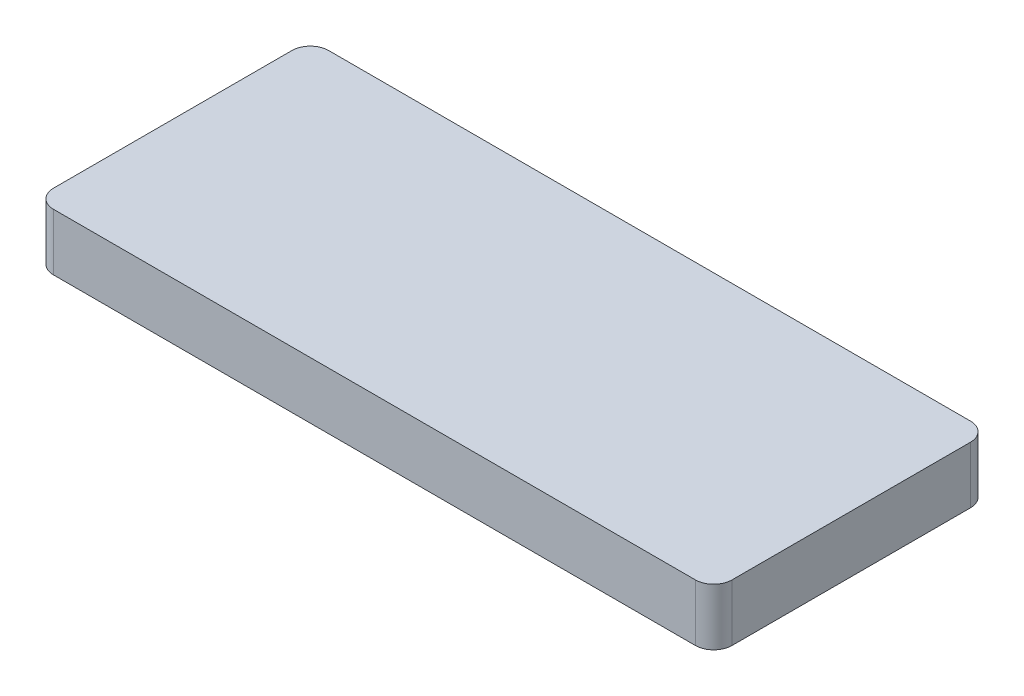
ISO-10303-21;
HEADER;
FILE_DESCRIPTION(('STEP AP214'),'2;1');
FILE_NAME('part.step','',(''),(''),'','','');
FILE_SCHEMA(('AUTOMOTIVE_DESIGN { 1 0 10303 214 1 1 1 1 }'));
ENDSEC;
DATA;
#1=APPLICATION_CONTEXT('core data for automotive mechanical design processes');
#2=APPLICATION_PROTOCOL_DEFINITION('international standard','automotive_design',2000,#1);
#3=PRODUCT_CONTEXT('',#1,'mechanical');
#4=PRODUCT('Part','Part','',(#3));
#5=PRODUCT_RELATED_PRODUCT_CATEGORY('part','',(#4));
#6=PRODUCT_DEFINITION_FORMATION('','',#4);
#7=PRODUCT_DEFINITION_CONTEXT('part definition',#1,'design');
#8=PRODUCT_DEFINITION('design','',#6,#7);
#9=PRODUCT_DEFINITION_SHAPE('','',#8);
#10=(LENGTH_UNIT() NAMED_UNIT(*) SI_UNIT(.MILLI.,.METRE.));
#11=(NAMED_UNIT(*) PLANE_ANGLE_UNIT() SI_UNIT($,.RADIAN.));
#12=(NAMED_UNIT(*) SI_UNIT($,.STERADIAN.) SOLID_ANGLE_UNIT());
#13=UNCERTAINTY_MEASURE_WITH_UNIT(LENGTH_MEASURE(1.E-05),#10,'distance_accuracy_value','');
#14=(GEOMETRIC_REPRESENTATION_CONTEXT(3) GLOBAL_UNCERTAINTY_ASSIGNED_CONTEXT((#13)) GLOBAL_UNIT_ASSIGNED_CONTEXT((#10,
#11,#12)) REPRESENTATION_CONTEXT('',''));
#15=CARTESIAN_POINT('',(0.,0.,0.));
#16=DIRECTION('',(0.,0.,1.));
#17=DIRECTION('',(1.,0.,0.));
#18=AXIS2_PLACEMENT_3D('',#15,#16,#17);
#19=CARTESIAN_POINT('',(17.5,3.1,6.5));
#20=DIRECTION('',(0.,-1.,0.));
#21=DIRECTION('',(0.,0.,-1.));
#22=AXIS2_PLACEMENT_3D('',#19,#20,#21);
#23=CYLINDRICAL_SURFACE('',#22,1.);
#24=CARTESIAN_POINT('',(17.5,0.,6.5));
#25=DIRECTION('',(0.,1.,0.));
#26=DIRECTION('',(0.,0.,1.));
#27=AXIS2_PLACEMENT_3D('',#24,#25,#26);
#28=CIRCLE('',#27,1.);
#29=CARTESIAN_POINT('',(17.5,0.,7.5));
#30=VERTEX_POINT('',#29);
#31=CARTESIAN_POINT('',(18.5,0.,6.49999999999999));
#32=VERTEX_POINT('',#31);
#33=EDGE_CURVE('E146',#30,#32,#28,.T.);
#34=ORIENTED_EDGE('',*,*,#33,.T.);
#35=DIRECTION('',(0.,-1.,0.));
#36=VECTOR('',#35,1.);
#37=CARTESIAN_POINT('',(18.5,3.1,6.49999999999999));
#38=LINE('',#37,#36);
#39=CARTESIAN_POINT('',(18.5,3.1,6.49999999999999));
#40=VERTEX_POINT('',#39);
#41=EDGE_CURVE('E11',#40,#32,#38,.T.);
#42=ORIENTED_EDGE('',*,*,#41,.F.);
#43=CARTESIAN_POINT('',(17.5,3.1,6.5));
#44=DIRECTION('',(0.,1.,0.));
#45=DIRECTION('',(0.,0.,1.));
#46=AXIS2_PLACEMENT_3D('',#43,#44,#45);
#47=CIRCLE('',#46,1.);
#48=CARTESIAN_POINT('',(17.5,3.1,7.5));
#49=VERTEX_POINT('',#48);
#50=EDGE_CURVE('E168',#49,#40,#47,.T.);
#51=ORIENTED_EDGE('',*,*,#50,.F.);
#52=DIRECTION('',(0.,-1.,0.));
#53=VECTOR('',#52,1.);
#54=CARTESIAN_POINT('',(17.5,3.1,7.5));
#55=LINE('',#54,#53);
#56=EDGE_CURVE('E142',#49,#30,#55,.T.);
#57=ORIENTED_EDGE('',*,*,#56,.T.);
#58=EDGE_LOOP('',(#34,#42,#51,#57));
#59=FACE_BOUND('',#58,.T.);
#60=ADVANCED_FACE('F45',(#59),#23,.T.);
#61=CARTESIAN_POINT('',(18.5,3.1,6.49999999999999));
#62=DIRECTION('',(-1.,0.,0.));
#63=DIRECTION('',(0.,0.,1.));
#64=AXIS2_PLACEMENT_3D('',#61,#62,#63);
#65=PLANE('',#64);
#66=DIRECTION('',(0.,0.,-1.));
#67=VECTOR('',#66,1.);
#68=CARTESIAN_POINT('',(18.5,0.,6.49999999999999));
#69=LINE('',#68,#67);
#70=CARTESIAN_POINT('',(18.5,0.,-6.49999999999999));
#71=VERTEX_POINT('',#70);
#72=EDGE_CURVE('E150',#32,#71,#69,.T.);
#73=ORIENTED_EDGE('',*,*,#72,.T.);
#74=DIRECTION('',(0.,-1.,0.));
#75=VECTOR('',#74,1.);
#76=CARTESIAN_POINT('',(18.5,3.1,-6.49999999999999));
#77=LINE('',#76,#75);
#78=CARTESIAN_POINT('',(18.5,3.1,-6.49999999999999));
#79=VERTEX_POINT('',#78);
#80=EDGE_CURVE('E54',#79,#71,#77,.T.);
#81=ORIENTED_EDGE('',*,*,#80,.F.);
#82=DIRECTION('',(0.,0.,-1.));
#83=VECTOR('',#82,1.);
#84=CARTESIAN_POINT('',(18.5,3.1,6.49999999999999));
#85=LINE('',#84,#83);
#86=EDGE_CURVE('E105',#40,#79,#85,.T.);
#87=ORIENTED_EDGE('',*,*,#86,.F.);
#88=ORIENTED_EDGE('',*,*,#41,.T.);
#89=EDGE_LOOP('',(#73,#81,#87,#88));
#90=FACE_BOUND('',#89,.T.);
#91=ADVANCED_FACE('F214',(#90),#65,.F.);
#92=CARTESIAN_POINT('',(17.5,3.1,-6.5));
#93=DIRECTION('',(0.,-1.,0.));
#94=DIRECTION('',(0.,0.,-1.));
#95=AXIS2_PLACEMENT_3D('',#92,#93,#94);
#96=CYLINDRICAL_SURFACE('',#95,1.);
#97=CARTESIAN_POINT('',(17.5,0.,-6.5));
#98=DIRECTION('',(0.,1.,0.));
#99=DIRECTION('',(0.,0.,-1.));
#100=AXIS2_PLACEMENT_3D('',#97,#98,#99);
#101=CIRCLE('',#100,1.);
#102=CARTESIAN_POINT('',(17.5,0.,-7.5));
#103=VERTEX_POINT('',#102);
#104=EDGE_CURVE('E153',#71,#103,#101,.T.);
#105=ORIENTED_EDGE('',*,*,#104,.T.);
#106=DIRECTION('',(0.,-1.,0.));
#107=VECTOR('',#106,1.);
#108=CARTESIAN_POINT('',(17.5,3.1,-7.5));
#109=LINE('',#108,#107);
#110=CARTESIAN_POINT('',(17.5,3.1,-7.5));
#111=VERTEX_POINT('',#110);
#112=EDGE_CURVE('E179',#111,#103,#109,.T.);
#113=ORIENTED_EDGE('',*,*,#112,.F.);
#114=CARTESIAN_POINT('',(17.5,3.1,-6.5));
#115=DIRECTION('',(0.,1.,0.));
#116=DIRECTION('',(0.,0.,-1.));
#117=AXIS2_PLACEMENT_3D('',#114,#115,#116);
#118=CIRCLE('',#117,1.);
#119=EDGE_CURVE('E189',#79,#111,#118,.T.);
#120=ORIENTED_EDGE('',*,*,#119,.F.);
#121=ORIENTED_EDGE('',*,*,#80,.T.);
#122=EDGE_LOOP('',(#105,#113,#120,#121));
#123=FACE_BOUND('',#122,.T.);
#124=ADVANCED_FACE('F187',(#123),#96,.T.);
#125=CARTESIAN_POINT('',(-17.5,3.1,-7.5));
#126=DIRECTION('',(0.,0.,1.));
#127=DIRECTION('',(1.,0.,0.));
#128=AXIS2_PLACEMENT_3D('',#125,#126,#127);
#129=PLANE('',#128);
#130=DIRECTION('',(-1.,0.,0.));
#131=VECTOR('',#130,1.);
#132=CARTESIAN_POINT('',(-17.5,0.,-7.5));
#133=LINE('',#132,#131);
#134=CARTESIAN_POINT('',(-17.5,0.,-7.5));
#135=VERTEX_POINT('',#134);
#136=EDGE_CURVE('E156',#103,#135,#133,.T.);
#137=ORIENTED_EDGE('',*,*,#136,.T.);
#138=DIRECTION('',(0.,-1.,0.));
#139=VECTOR('',#138,1.);
#140=CARTESIAN_POINT('',(-17.5,3.1,-7.5));
#141=LINE('',#140,#139);
#142=CARTESIAN_POINT('',(-17.5,3.1,-7.5));
#143=VERTEX_POINT('',#142);
#144=EDGE_CURVE('E175',#143,#135,#141,.T.);
#145=ORIENTED_EDGE('',*,*,#144,.F.);
#146=DIRECTION('',(-1.,0.,0.));
#147=VECTOR('',#146,1.);
#148=CARTESIAN_POINT('',(-17.5,3.1,-7.5));
#149=LINE('',#148,#147);
#150=EDGE_CURVE('E202',#111,#143,#149,.T.);
#151=ORIENTED_EDGE('',*,*,#150,.F.);
#152=ORIENTED_EDGE('',*,*,#112,.T.);
#153=EDGE_LOOP('',(#137,#145,#151,#152));
#154=FACE_BOUND('',#153,.T.);
#155=ADVANCED_FACE('F197',(#154),#129,.F.);
#156=CARTESIAN_POINT('',(-17.5,3.1,-6.5));
#157=DIRECTION('',(0.,-1.,0.));
#158=DIRECTION('',(0.,0.,-1.));
#159=AXIS2_PLACEMENT_3D('',#156,#157,#158);
#160=CYLINDRICAL_SURFACE('',#159,1.);
#161=CARTESIAN_POINT('',(-17.5,0.,-6.5));
#162=DIRECTION('',(0.,1.,0.));
#163=DIRECTION('',(0.,0.,-1.));
#164=AXIS2_PLACEMENT_3D('',#161,#162,#163);
#165=CIRCLE('',#164,1.);
#166=CARTESIAN_POINT('',(-18.5,0.,-6.49999999999999));
#167=VERTEX_POINT('',#166);
#168=EDGE_CURVE('E159',#135,#167,#165,.T.);
#169=ORIENTED_EDGE('',*,*,#168,.T.);
#170=DIRECTION('',(0.,-1.,0.));
#171=VECTOR('',#170,1.);
#172=CARTESIAN_POINT('',(-18.5,3.1,-6.49999999999999));
#173=LINE('',#172,#171);
#174=CARTESIAN_POINT('',(-18.5,3.1,-6.49999999999999));
#175=VERTEX_POINT('',#174);
#176=EDGE_CURVE('E135',#175,#167,#173,.T.);
#177=ORIENTED_EDGE('',*,*,#176,.F.);
#178=CARTESIAN_POINT('',(-17.5,3.1,-6.5));
#179=DIRECTION('',(0.,1.,0.));
#180=DIRECTION('',(0.,0.,-1.));
#181=AXIS2_PLACEMENT_3D('',#178,#179,#180);
#182=CIRCLE('',#181,1.);
#183=EDGE_CURVE('E124',#143,#175,#182,.T.);
#184=ORIENTED_EDGE('',*,*,#183,.F.);
#185=ORIENTED_EDGE('',*,*,#144,.T.);
#186=EDGE_LOOP('',(#169,#177,#184,#185));
#187=FACE_BOUND('',#186,.T.);
#188=ADVANCED_FACE('F200',(#187),#160,.T.);
#189=CARTESIAN_POINT('',(-18.5,3.1,6.49999999999999));
#190=DIRECTION('',(1.,0.,0.));
#191=DIRECTION('',(0.,0.,-1.));
#192=AXIS2_PLACEMENT_3D('',#189,#190,#191);
#193=PLANE('',#192);
#194=DIRECTION('',(0.,0.,1.));
#195=VECTOR('',#194,1.);
#196=CARTESIAN_POINT('',(-18.5,0.,6.49999999999999));
#197=LINE('',#196,#195);
#198=CARTESIAN_POINT('',(-18.5,0.,6.49999999999999));
#199=VERTEX_POINT('',#198);
#200=EDGE_CURVE('E133',#167,#199,#197,.T.);
#201=ORIENTED_EDGE('',*,*,#200,.T.);
#202=DIRECTION('',(0.,-1.,0.));
#203=VECTOR('',#202,1.);
#204=CARTESIAN_POINT('',(-18.5,3.1,6.49999999999999));
#205=LINE('',#204,#203);
#206=CARTESIAN_POINT('',(-18.5,3.1,6.49999999999999));
#207=VERTEX_POINT('',#206);
#208=EDGE_CURVE('E130',#207,#199,#205,.T.);
#209=ORIENTED_EDGE('',*,*,#208,.F.);
#210=DIRECTION('',(0.,0.,1.));
#211=VECTOR('',#210,1.);
#212=CARTESIAN_POINT('',(-18.5,3.1,6.49999999999999));
#213=LINE('',#212,#211);
#214=EDGE_CURVE('E118',#175,#207,#213,.T.);
#215=ORIENTED_EDGE('',*,*,#214,.F.);
#216=ORIENTED_EDGE('',*,*,#176,.T.);
#217=EDGE_LOOP('',(#201,#209,#215,#216));
#218=FACE_BOUND('',#217,.T.);
#219=ADVANCED_FACE('F131',(#218),#193,.F.);
#220=CARTESIAN_POINT('',(-17.5,3.1,6.5));
#221=DIRECTION('',(0.,-1.,0.));
#222=DIRECTION('',(0.,0.,-1.));
#223=AXIS2_PLACEMENT_3D('',#220,#221,#222);
#224=CYLINDRICAL_SURFACE('',#223,1.);
#225=CARTESIAN_POINT('',(-17.5,0.,6.5));
#226=DIRECTION('',(0.,1.,0.));
#227=DIRECTION('',(0.,0.,-1.));
#228=AXIS2_PLACEMENT_3D('',#225,#226,#227);
#229=CIRCLE('',#228,1.);
#230=CARTESIAN_POINT('',(-17.5,0.,7.5));
#231=VERTEX_POINT('',#230);
#232=EDGE_CURVE('E91',#199,#231,#229,.T.);
#233=ORIENTED_EDGE('',*,*,#232,.T.);
#234=DIRECTION('',(0.,-1.,0.));
#235=VECTOR('',#234,1.);
#236=CARTESIAN_POINT('',(-17.5,3.1,7.5));
#237=LINE('',#236,#235);
#238=CARTESIAN_POINT('',(-17.5,3.1,7.5));
#239=VERTEX_POINT('',#238);
#240=EDGE_CURVE('E136',#239,#231,#237,.T.);
#241=ORIENTED_EDGE('',*,*,#240,.F.);
#242=CARTESIAN_POINT('',(-17.5,3.1,6.5));
#243=DIRECTION('',(0.,1.,0.));
#244=DIRECTION('',(0.,0.,-1.));
#245=AXIS2_PLACEMENT_3D('',#242,#243,#244);
#246=CIRCLE('',#245,1.);
#247=EDGE_CURVE('E122',#207,#239,#246,.T.);
#248=ORIENTED_EDGE('',*,*,#247,.F.);
#249=ORIENTED_EDGE('',*,*,#208,.T.);
#250=EDGE_LOOP('',(#233,#241,#248,#249));
#251=FACE_BOUND('',#250,.T.);
#252=ADVANCED_FACE('F138',(#251),#224,.T.);
#253=CARTESIAN_POINT('',(-17.5,3.1,7.5));
#254=DIRECTION('',(0.,0.,-1.));
#255=DIRECTION('',(-1.,0.,0.));
#256=AXIS2_PLACEMENT_3D('',#253,#254,#255);
#257=PLANE('',#256);
#258=DIRECTION('',(1.,0.,0.));
#259=VECTOR('',#258,1.);
#260=CARTESIAN_POINT('',(-17.5,0.,7.5));
#261=LINE('',#260,#259);
#262=EDGE_CURVE('E97',#231,#30,#261,.T.);
#263=ORIENTED_EDGE('',*,*,#262,.T.);
#264=ORIENTED_EDGE('',*,*,#56,.F.);
#265=DIRECTION('',(1.,0.,0.));
#266=VECTOR('',#265,1.);
#267=CARTESIAN_POINT('',(-17.5,3.1,7.5));
#268=LINE('',#267,#266);
#269=EDGE_CURVE('E62',#239,#49,#268,.T.);
#270=ORIENTED_EDGE('',*,*,#269,.F.);
#271=ORIENTED_EDGE('',*,*,#240,.T.);
#272=EDGE_LOOP('',(#263,#264,#270,#271));
#273=FACE_BOUND('',#272,.T.);
#274=ADVANCED_FACE('F230',(#273),#257,.F.);
#275=CARTESIAN_POINT('',(17.5,3.1,6.5));
#276=DIRECTION('',(0.,1.,0.));
#277=DIRECTION('',(0.,0.,1.));
#278=AXIS2_PLACEMENT_3D('',#275,#276,#277);
#279=PLANE('',#278);
#280=ORIENTED_EDGE('',*,*,#50,.T.);
#281=ORIENTED_EDGE('',*,*,#86,.T.);
#282=ORIENTED_EDGE('',*,*,#119,.T.);
#283=ORIENTED_EDGE('',*,*,#150,.T.);
#284=ORIENTED_EDGE('',*,*,#183,.T.);
#285=ORIENTED_EDGE('',*,*,#214,.T.);
#286=ORIENTED_EDGE('',*,*,#247,.T.);
#287=ORIENTED_EDGE('',*,*,#269,.T.);
#288=EDGE_LOOP('',(#280,#281,#282,#283,#284,#285,#286,#287));
#289=FACE_BOUND('',#288,.T.);
#290=ADVANCED_FACE('F120',(#289),#279,.T.);
#291=CARTESIAN_POINT('',(17.5,0.,6.5));
#292=DIRECTION('',(0.,1.,0.));
#293=DIRECTION('',(0.,0.,1.));
#294=AXIS2_PLACEMENT_3D('',#291,#292,#293);
#295=PLANE('',#294);
#296=ORIENTED_EDGE('',*,*,#33,.F.);
#297=ORIENTED_EDGE('',*,*,#262,.F.);
#298=ORIENTED_EDGE('',*,*,#232,.F.);
#299=ORIENTED_EDGE('',*,*,#200,.F.);
#300=ORIENTED_EDGE('',*,*,#168,.F.);
#301=ORIENTED_EDGE('',*,*,#136,.F.);
#302=ORIENTED_EDGE('',*,*,#104,.F.);
#303=ORIENTED_EDGE('',*,*,#72,.F.);
#304=EDGE_LOOP('',(#296,#297,#298,#299,#300,#301,#302,#303));
#305=FACE_BOUND('',#304,.T.);
#306=ADVANCED_FACE('F193',(#305),#295,.F.);
#307=CLOSED_SHELL('',(#60,#91,#124,#155,#188,#219,#252,#274,#290,#306));
#308=MANIFOLD_SOLID_BREP('B2',#307);
#309=ADVANCED_BREP_SHAPE_REPRESENTATION('',(#18,#308),#14);
#310=SHAPE_DEFINITION_REPRESENTATION(#9,#309);
ENDSEC;
END-ISO-10303-21;
